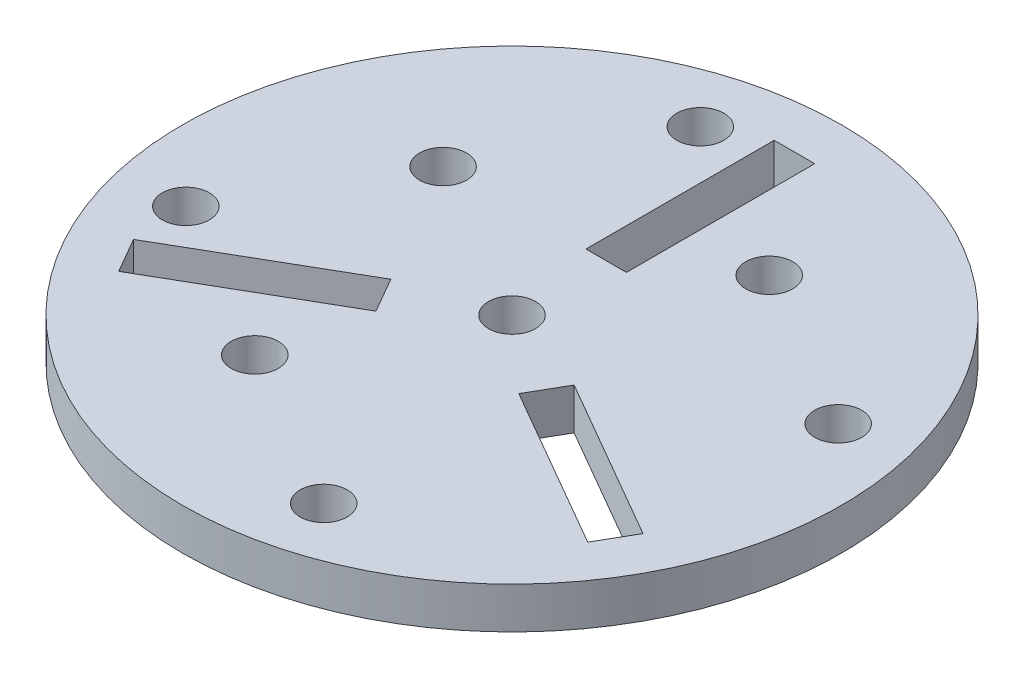
ISO-10303-21;
HEADER;
FILE_DESCRIPTION(('STEP AP214'),'2;1');
FILE_NAME('part.step','',(''),(''),'','','');
FILE_SCHEMA(('AUTOMOTIVE_DESIGN { 1 0 10303 214 1 1 1 1 }'));
ENDSEC;
DATA;
#1=APPLICATION_CONTEXT('core data for automotive mechanical design processes');
#2=APPLICATION_PROTOCOL_DEFINITION('international standard','automotive_design',2000,#1);
#3=PRODUCT_CONTEXT('',#1,'mechanical');
#4=PRODUCT('Part','Part','',(#3));
#5=PRODUCT_RELATED_PRODUCT_CATEGORY('part','',(#4));
#6=PRODUCT_DEFINITION_FORMATION('','',#4);
#7=PRODUCT_DEFINITION_CONTEXT('part definition',#1,'design');
#8=PRODUCT_DEFINITION('design','',#6,#7);
#9=PRODUCT_DEFINITION_SHAPE('','',#8);
#10=(LENGTH_UNIT() NAMED_UNIT(*) SI_UNIT(.MILLI.,.METRE.));
#11=(NAMED_UNIT(*) PLANE_ANGLE_UNIT() SI_UNIT($,.RADIAN.));
#12=(NAMED_UNIT(*) SI_UNIT($,.STERADIAN.) SOLID_ANGLE_UNIT());
#13=UNCERTAINTY_MEASURE_WITH_UNIT(LENGTH_MEASURE(1.E-05),#10,'distance_accuracy_value','');
#14=(GEOMETRIC_REPRESENTATION_CONTEXT(3) GLOBAL_UNCERTAINTY_ASSIGNED_CONTEXT((#13)) GLOBAL_UNIT_ASSIGNED_CONTEXT((#10,
#11,#12)) REPRESENTATION_CONTEXT('',''));
#15=CARTESIAN_POINT('',(0.,0.,0.));
#16=DIRECTION('',(0.,0.,1.));
#17=DIRECTION('',(1.,0.,0.));
#18=AXIS2_PLACEMENT_3D('',#15,#16,#17);
#19=CARTESIAN_POINT('',(0.,5.588,0.));
#20=DIRECTION('',(0.,1.,0.));
#21=DIRECTION('',(0.,0.,1.));
#22=AXIS2_PLACEMENT_3D('',#19,#20,#21);
#23=PLANE('',#22);
#24=CARTESIAN_POINT('',(12.6999999999999,5.588,-21.9970452561248));
#25=DIRECTION('',(0.,1.,0.));
#26=DIRECTION('',(0.,0.,1.));
#27=AXIS2_PLACEMENT_3D('',#24,#25,#26);
#28=CIRCLE('',#27,3.175);
#29=CARTESIAN_POINT('',(12.6999999999999,5.588,-18.8220452561248));
#30=VERTEX_POINT('',#29);
#31=EDGE_CURVE('E405',#30,#30,#28,.T.);
#32=ORIENTED_EDGE('',*,*,#31,.F.);
#33=EDGE_LOOP('',(#32));
#34=FACE_BOUND('',#33,.T.);
#35=CARTESIAN_POINT('',(-9.29704525612483,5.588,-34.6970452561247));
#36=DIRECTION('',(0.,1.,0.));
#37=DIRECTION('',(0.,0.,1.));
#38=AXIS2_PLACEMENT_3D('',#35,#36,#37);
#39=CIRCLE('',#38,3.175);
#40=CARTESIAN_POINT('',(-9.29704525612483,5.588,-31.5220452561247));
#41=VERTEX_POINT('',#40);
#42=EDGE_CURVE('E407',#41,#41,#39,.T.);
#43=ORIENTED_EDGE('',*,*,#42,.F.);
#44=EDGE_LOOP('',(#43));
#45=FACE_BOUND('',#44,.T.);
#46=CARTESIAN_POINT('',(-21.9970452561248,5.588,-12.7));
#47=DIRECTION('',(0.,1.,0.));
#48=DIRECTION('',(0.,0.,1.));
#49=AXIS2_PLACEMENT_3D('',#46,#47,#48);
#50=CIRCLE('',#49,3.175);
#51=CARTESIAN_POINT('',(-21.9970452561248,5.588,-9.52499999999995));
#52=VERTEX_POINT('',#51);
#53=EDGE_CURVE('E413',#52,#52,#50,.T.);
#54=ORIENTED_EDGE('',*,*,#53,.F.);
#55=EDGE_LOOP('',(#54));
#56=FACE_BOUND('',#55,.T.);
#57=CARTESIAN_POINT('',(-34.6970452561247,5.588,9.29704525612481));
#58=DIRECTION('',(0.,1.,0.));
#59=DIRECTION('',(0.,0.,1.));
#60=AXIS2_PLACEMENT_3D('',#57,#58,#59);
#61=CIRCLE('',#60,3.175);
#62=CARTESIAN_POINT('',(-34.6970452561247,5.588,12.4720452561248));
#63=VERTEX_POINT('',#62);
#64=EDGE_CURVE('E419',#63,#63,#61,.T.);
#65=ORIENTED_EDGE('',*,*,#64,.F.);
#66=EDGE_LOOP('',(#65));
#67=FACE_BOUND('',#66,.T.);
#68=CARTESIAN_POINT('',(-12.7,5.588,21.9970452561248));
#69=DIRECTION('',(0.,1.,0.));
#70=DIRECTION('',(0.,0.,1.));
#71=AXIS2_PLACEMENT_3D('',#68,#69,#70);
#72=CIRCLE('',#71,3.175);
#73=CARTESIAN_POINT('',(-12.7,5.588,25.1720452561248));
#74=VERTEX_POINT('',#73);
#75=EDGE_CURVE('E425',#74,#74,#72,.T.);
#76=ORIENTED_EDGE('',*,*,#75,.F.);
#77=EDGE_LOOP('',(#76));
#78=FACE_BOUND('',#77,.T.);
#79=CARTESIAN_POINT('',(9.29704525612482,5.588,34.6970452561247));
#80=DIRECTION('',(0.,1.,0.));
#81=DIRECTION('',(0.,0.,1.));
#82=AXIS2_PLACEMENT_3D('',#79,#80,#81);
#83=CIRCLE('',#82,3.175);
#84=CARTESIAN_POINT('',(9.29704525612482,5.588,37.8720452561247));
#85=VERTEX_POINT('',#84);
#86=EDGE_CURVE('E431',#85,#85,#83,.T.);
#87=ORIENTED_EDGE('',*,*,#86,.F.);
#88=EDGE_LOOP('',(#87));
#89=FACE_BOUND('',#88,.T.);
#90=CARTESIAN_POINT('',(34.6970452561247,5.588,-9.29704525612482));
#91=DIRECTION('',(0.,1.,0.));
#92=DIRECTION('',(0.,0.,1.));
#93=AXIS2_PLACEMENT_3D('',#90,#91,#92);
#94=CIRCLE('',#93,3.175);
#95=CARTESIAN_POINT('',(34.6970452561247,5.588,-6.12204525612482));
#96=VERTEX_POINT('',#95);
#97=EDGE_CURVE('E437',#96,#96,#94,.T.);
#98=ORIENTED_EDGE('',*,*,#97,.F.);
#99=EDGE_LOOP('',(#98));
#100=FACE_BOUND('',#99,.T.);
#101=CARTESIAN_POINT('',(0.,5.588,0.));
#102=DIRECTION('',(0.,1.,0.));
#103=DIRECTION('',(0.,0.,1.));
#104=AXIS2_PLACEMENT_3D('',#101,#102,#103);
#105=CIRCLE('',#104,3.175);
#106=CARTESIAN_POINT('',(0.,5.588,3.175));
#107=VERTEX_POINT('',#106);
#108=EDGE_CURVE('E443',#107,#107,#105,.T.);
#109=ORIENTED_EDGE('',*,*,#108,.F.);
#110=EDGE_LOOP('',(#109));
#111=FACE_BOUND('',#110,.T.);
#112=DIRECTION('',(-0.5,0.,0.866025403784439));
#113=VECTOR('',#112,1.);
#114=CARTESIAN_POINT('',(12.3637726280624,5.588,3.98531763496659));
#115=LINE('',#114,#113);
#116=CARTESIAN_POINT('',(12.3637726280624,5.588,3.98531763496659));
#117=VERTEX_POINT('',#116);
#118=CARTESIAN_POINT('',(9.63327262806238,5.588,8.71468236503341));
#119=VERTEX_POINT('',#118);
#120=EDGE_CURVE('E171',#117,#119,#115,.T.);
#121=ORIENTED_EDGE('',*,*,#120,.F.);
#122=DIRECTION('',(-0.866025403784439,0.,-0.5));
#123=VECTOR('',#122,1.);
#124=CARTESIAN_POINT('',(34.3608178841871,5.588,16.6853176349666));
#125=LINE('',#124,#123);
#126=CARTESIAN_POINT('',(34.3608178841871,5.588,16.6853176349666));
#127=VERTEX_POINT('',#126);
#128=EDGE_CURVE('E169',#127,#117,#125,.T.);
#129=ORIENTED_EDGE('',*,*,#128,.F.);
#130=DIRECTION('',(0.5,0.,-0.866025403784439));
#131=VECTOR('',#130,1.);
#132=CARTESIAN_POINT('',(34.3608178841871,5.588,16.6853176349666));
#133=LINE('',#132,#131);
#134=CARTESIAN_POINT('',(31.6303178841871,5.588,21.4146823650334));
#135=VERTEX_POINT('',#134);
#136=EDGE_CURVE('E177',#135,#127,#133,.T.);
#137=ORIENTED_EDGE('',*,*,#136,.F.);
#138=DIRECTION('',(0.866025403784439,0.,0.5));
#139=VECTOR('',#138,1.);
#140=CARTESIAN_POINT('',(31.6303178841871,5.588,21.4146823650334));
#141=LINE('',#140,#139);
#142=EDGE_CURVE('E174',#119,#135,#141,.T.);
#143=ORIENTED_EDGE('',*,*,#142,.F.);
#144=EDGE_LOOP('',(#121,#129,#137,#143));
#145=FACE_BOUND('',#144,.T.);
#146=CARTESIAN_POINT('',(0.,5.588,0.));
#147=DIRECTION('',(0.,1.,0.));
#148=DIRECTION('',(0.,0.,1.));
#149=AXIS2_PLACEMENT_3D('',#146,#147,#148);
#150=CIRCLE('',#149,44.45);
#151=CARTESIAN_POINT('',(0.,5.588,44.45));
#152=VERTEX_POINT('',#151);
#153=EDGE_CURVE('E12',#152,#152,#150,.T.);
#154=ORIENTED_EDGE('',*,*,#153,.T.);
#155=EDGE_LOOP('',(#154));
#156=FACE_BOUND('',#155,.T.);
#157=DIRECTION('',(1.,0.,0.));
#158=VECTOR('',#157,1.);
#159=CARTESIAN_POINT('',(-2.7305,5.588,-12.7));
#160=LINE('',#159,#158);
#161=CARTESIAN_POINT('',(-2.7305,5.588,-12.7));
#162=VERTEX_POINT('',#161);
#163=CARTESIAN_POINT('',(2.7305,5.588,-12.7));
#164=VERTEX_POINT('',#163);
#165=EDGE_CURVE('E202',#162,#164,#160,.T.);
#166=ORIENTED_EDGE('',*,*,#165,.F.);
#167=DIRECTION('',(0.,0.,1.));
#168=VECTOR('',#167,1.);
#169=CARTESIAN_POINT('',(-2.7305,5.588,-38.1));
#170=LINE('',#169,#168);
#171=CARTESIAN_POINT('',(-2.7305,5.588,-38.1));
#172=VERTEX_POINT('',#171);
#173=EDGE_CURVE('E200',#172,#162,#170,.T.);
#174=ORIENTED_EDGE('',*,*,#173,.F.);
#175=DIRECTION('',(-1.,0.,0.));
#176=VECTOR('',#175,1.);
#177=CARTESIAN_POINT('',(-2.7305,5.588,-38.1));
#178=LINE('',#177,#176);
#179=CARTESIAN_POINT('',(2.7305,5.588,-38.1));
#180=VERTEX_POINT('',#179);
#181=EDGE_CURVE('E208',#180,#172,#178,.T.);
#182=ORIENTED_EDGE('',*,*,#181,.F.);
#183=DIRECTION('',(0.,0.,-1.));
#184=VECTOR('',#183,1.);
#185=CARTESIAN_POINT('',(2.7305,5.588,-38.1));
#186=LINE('',#185,#184);
#187=EDGE_CURVE('E205',#164,#180,#186,.T.);
#188=ORIENTED_EDGE('',*,*,#187,.F.);
#189=EDGE_LOOP('',(#166,#174,#182,#188));
#190=FACE_BOUND('',#189,.T.);
#191=DIRECTION('',(-0.5,0.,-0.866025403784438));
#192=VECTOR('',#191,1.);
#193=CARTESIAN_POINT('',(-9.63327262806236,5.588,8.71468236503342));
#194=LINE('',#193,#192);
#195=CARTESIAN_POINT('',(-9.63327262806236,5.588,8.71468236503342));
#196=VERTEX_POINT('',#195);
#197=CARTESIAN_POINT('',(-12.3637726280624,5.588,3.9853176349666));
#198=VERTEX_POINT('',#197);
#199=EDGE_CURVE('E139',#196,#198,#194,.T.);
#200=ORIENTED_EDGE('',*,*,#199,.F.);
#201=DIRECTION('',(0.866025403784438,0.,-0.5));
#202=VECTOR('',#201,1.);
#203=CARTESIAN_POINT('',(-31.6303178841871,5.588,21.4146823650334));
#204=LINE('',#203,#202);
#205=CARTESIAN_POINT('',(-31.6303178841871,5.588,21.4146823650334));
#206=VERTEX_POINT('',#205);
#207=EDGE_CURVE('E131',#206,#196,#204,.T.);
#208=ORIENTED_EDGE('',*,*,#207,.F.);
#209=DIRECTION('',(0.500000000000001,0.,0.866025403784438));
#210=VECTOR('',#209,1.);
#211=CARTESIAN_POINT('',(-31.6303178841871,5.588,21.4146823650334));
#212=LINE('',#211,#210);
#213=CARTESIAN_POINT('',(-34.3608178841871,5.588,16.6853176349666));
#214=VERTEX_POINT('',#213);
#215=EDGE_CURVE('E153',#214,#206,#212,.T.);
#216=ORIENTED_EDGE('',*,*,#215,.F.);
#217=DIRECTION('',(-0.866025403784438,0.,0.5));
#218=VECTOR('',#217,1.);
#219=CARTESIAN_POINT('',(-34.3608178841871,5.588,16.6853176349666));
#220=LINE('',#219,#218);
#221=EDGE_CURVE('E151',#198,#214,#220,.T.);
#222=ORIENTED_EDGE('',*,*,#221,.F.);
#223=EDGE_LOOP('',(#200,#208,#216,#222));
#224=FACE_BOUND('',#223,.T.);
#225=ADVANCED_FACE('F42',(#34,#45,#56,#67,#78,#89,#100,#111,#145,#156,#190,#224),#23,.T.);
#226=CARTESIAN_POINT('',(0.,0.,0.));
#227=DIRECTION('',(0.,1.,0.));
#228=DIRECTION('',(0.,0.,1.));
#229=AXIS2_PLACEMENT_3D('',#226,#227,#228);
#230=PLANE('',#229);
#231=CARTESIAN_POINT('',(12.6999999999999,0.,-21.9970452561248));
#232=DIRECTION('',(0.,1.,0.));
#233=DIRECTION('',(0.,0.,1.));
#234=AXIS2_PLACEMENT_3D('',#231,#232,#233);
#235=CIRCLE('',#234,3.175);
#236=CARTESIAN_POINT('',(12.6999999999999,0.,-18.8220452561248));
#237=VERTEX_POINT('',#236);
#238=EDGE_CURVE('E403',#237,#237,#235,.T.);
#239=ORIENTED_EDGE('',*,*,#238,.T.);
#240=EDGE_LOOP('',(#239));
#241=FACE_BOUND('',#240,.T.);
#242=CARTESIAN_POINT('',(-9.29704525612483,0.,-34.6970452561247));
#243=DIRECTION('',(0.,1.,0.));
#244=DIRECTION('',(0.,0.,1.));
#245=AXIS2_PLACEMENT_3D('',#242,#243,#244);
#246=CIRCLE('',#245,3.175);
#247=CARTESIAN_POINT('',(-9.29704525612483,0.,-31.5220452561247));
#248=VERTEX_POINT('',#247);
#249=EDGE_CURVE('E410',#248,#248,#246,.T.);
#250=ORIENTED_EDGE('',*,*,#249,.T.);
#251=EDGE_LOOP('',(#250));
#252=FACE_BOUND('',#251,.T.);
#253=CARTESIAN_POINT('',(-21.9970452561248,0.,-12.7));
#254=DIRECTION('',(0.,1.,0.));
#255=DIRECTION('',(0.,0.,1.));
#256=AXIS2_PLACEMENT_3D('',#253,#254,#255);
#257=CIRCLE('',#256,3.175);
#258=CARTESIAN_POINT('',(-21.9970452561248,0.,-9.52499999999995));
#259=VERTEX_POINT('',#258);
#260=EDGE_CURVE('E416',#259,#259,#257,.T.);
#261=ORIENTED_EDGE('',*,*,#260,.T.);
#262=EDGE_LOOP('',(#261));
#263=FACE_BOUND('',#262,.T.);
#264=CARTESIAN_POINT('',(-34.6970452561247,0.,9.29704525612481));
#265=DIRECTION('',(0.,1.,0.));
#266=DIRECTION('',(0.,0.,1.));
#267=AXIS2_PLACEMENT_3D('',#264,#265,#266);
#268=CIRCLE('',#267,3.175);
#269=CARTESIAN_POINT('',(-34.6970452561247,0.,12.4720452561248));
#270=VERTEX_POINT('',#269);
#271=EDGE_CURVE('E422',#270,#270,#268,.T.);
#272=ORIENTED_EDGE('',*,*,#271,.T.);
#273=EDGE_LOOP('',(#272));
#274=FACE_BOUND('',#273,.T.);
#275=CARTESIAN_POINT('',(-12.7,0.,21.9970452561248));
#276=DIRECTION('',(0.,1.,0.));
#277=DIRECTION('',(0.,0.,1.));
#278=AXIS2_PLACEMENT_3D('',#275,#276,#277);
#279=CIRCLE('',#278,3.175);
#280=CARTESIAN_POINT('',(-12.7,0.,25.1720452561248));
#281=VERTEX_POINT('',#280);
#282=EDGE_CURVE('E428',#281,#281,#279,.T.);
#283=ORIENTED_EDGE('',*,*,#282,.T.);
#284=EDGE_LOOP('',(#283));
#285=FACE_BOUND('',#284,.T.);
#286=CARTESIAN_POINT('',(9.29704525612482,0.,34.6970452561247));
#287=DIRECTION('',(0.,1.,0.));
#288=DIRECTION('',(0.,0.,1.));
#289=AXIS2_PLACEMENT_3D('',#286,#287,#288);
#290=CIRCLE('',#289,3.175);
#291=CARTESIAN_POINT('',(9.29704525612482,0.,37.8720452561247));
#292=VERTEX_POINT('',#291);
#293=EDGE_CURVE('E434',#292,#292,#290,.T.);
#294=ORIENTED_EDGE('',*,*,#293,.T.);
#295=EDGE_LOOP('',(#294));
#296=FACE_BOUND('',#295,.T.);
#297=CARTESIAN_POINT('',(34.6970452561247,0.,-9.29704525612482));
#298=DIRECTION('',(0.,1.,0.));
#299=DIRECTION('',(0.,0.,1.));
#300=AXIS2_PLACEMENT_3D('',#297,#298,#299);
#301=CIRCLE('',#300,3.175);
#302=CARTESIAN_POINT('',(34.6970452561247,0.,-6.12204525612482));
#303=VERTEX_POINT('',#302);
#304=EDGE_CURVE('E440',#303,#303,#301,.T.);
#305=ORIENTED_EDGE('',*,*,#304,.T.);
#306=EDGE_LOOP('',(#305));
#307=FACE_BOUND('',#306,.T.);
#308=CARTESIAN_POINT('',(0.,0.,0.));
#309=DIRECTION('',(0.,1.,0.));
#310=DIRECTION('',(0.,0.,1.));
#311=AXIS2_PLACEMENT_3D('',#308,#309,#310);
#312=CIRCLE('',#311,3.175);
#313=CARTESIAN_POINT('',(0.,0.,3.175));
#314=VERTEX_POINT('',#313);
#315=EDGE_CURVE('E159',#314,#314,#312,.T.);
#316=ORIENTED_EDGE('',*,*,#315,.T.);
#317=EDGE_LOOP('',(#316));
#318=FACE_BOUND('',#317,.T.);
#319=DIRECTION('',(-0.866025403784439,0.,-0.5));
#320=VECTOR('',#319,1.);
#321=CARTESIAN_POINT('',(34.3608178841871,0.,16.6853176349666));
#322=LINE('',#321,#320);
#323=CARTESIAN_POINT('',(34.3608178841871,0.,16.6853176349666));
#324=VERTEX_POINT('',#323);
#325=CARTESIAN_POINT('',(12.3637726280624,0.,3.98531763496659));
#326=VERTEX_POINT('',#325);
#327=EDGE_CURVE('E147',#324,#326,#322,.T.);
#328=ORIENTED_EDGE('',*,*,#327,.T.);
#329=DIRECTION('',(-0.5,0.,0.866025403784439));
#330=VECTOR('',#329,1.);
#331=CARTESIAN_POINT('',(12.3637726280624,0.,3.98531763496659));
#332=LINE('',#331,#330);
#333=CARTESIAN_POINT('',(9.63327262806238,0.,8.71468236503341));
#334=VERTEX_POINT('',#333);
#335=EDGE_CURVE('E182',#326,#334,#332,.T.);
#336=ORIENTED_EDGE('',*,*,#335,.T.);
#337=DIRECTION('',(0.866025403784439,0.,0.5));
#338=VECTOR('',#337,1.);
#339=CARTESIAN_POINT('',(31.6303178841871,0.,21.4146823650334));
#340=LINE('',#339,#338);
#341=CARTESIAN_POINT('',(31.6303178841871,0.,21.4146823650334));
#342=VERTEX_POINT('',#341);
#343=EDGE_CURVE('E185',#334,#342,#340,.T.);
#344=ORIENTED_EDGE('',*,*,#343,.T.);
#345=DIRECTION('',(0.5,0.,-0.866025403784439));
#346=VECTOR('',#345,1.);
#347=CARTESIAN_POINT('',(34.3608178841871,0.,16.6853176349666));
#348=LINE('',#347,#346);
#349=EDGE_CURVE('E172',#342,#324,#348,.T.);
#350=ORIENTED_EDGE('',*,*,#349,.T.);
#351=EDGE_LOOP('',(#328,#336,#344,#350));
#352=FACE_BOUND('',#351,.T.);
#353=CARTESIAN_POINT('',(0.,0.,0.));
#354=DIRECTION('',(0.,1.,0.));
#355=DIRECTION('',(0.,0.,1.));
#356=AXIS2_PLACEMENT_3D('',#353,#354,#355);
#357=CIRCLE('',#356,44.45);
#358=CARTESIAN_POINT('',(0.,0.,44.45));
#359=VERTEX_POINT('',#358);
#360=EDGE_CURVE('E46',#359,#359,#357,.T.);
#361=ORIENTED_EDGE('',*,*,#360,.F.);
#362=EDGE_LOOP('',(#361));
#363=FACE_BOUND('',#362,.T.);
#364=DIRECTION('',(0.,0.,1.));
#365=VECTOR('',#364,1.);
#366=CARTESIAN_POINT('',(-2.7305,0.,-38.1));
#367=LINE('',#366,#365);
#368=CARTESIAN_POINT('',(-2.7305,0.,-38.1));
#369=VERTEX_POINT('',#368);
#370=CARTESIAN_POINT('',(-2.7305,0.,-12.7));
#371=VERTEX_POINT('',#370);
#372=EDGE_CURVE('E199',#369,#371,#367,.T.);
#373=ORIENTED_EDGE('',*,*,#372,.T.);
#374=DIRECTION('',(1.,0.,0.));
#375=VECTOR('',#374,1.);
#376=CARTESIAN_POINT('',(-2.7305,0.,-12.7));
#377=LINE('',#376,#375);
#378=CARTESIAN_POINT('',(2.7305,0.,-12.7));
#379=VERTEX_POINT('',#378);
#380=EDGE_CURVE('E213',#371,#379,#377,.T.);
#381=ORIENTED_EDGE('',*,*,#380,.T.);
#382=DIRECTION('',(0.,0.,-1.));
#383=VECTOR('',#382,1.);
#384=CARTESIAN_POINT('',(2.7305,0.,-38.1));
#385=LINE('',#384,#383);
#386=CARTESIAN_POINT('',(2.7305,0.,-38.1));
#387=VERTEX_POINT('',#386);
#388=EDGE_CURVE('E216',#379,#387,#385,.T.);
#389=ORIENTED_EDGE('',*,*,#388,.T.);
#390=DIRECTION('',(-1.,0.,0.));
#391=VECTOR('',#390,1.);
#392=CARTESIAN_POINT('',(-2.7305,0.,-38.1));
#393=LINE('',#392,#391);
#394=EDGE_CURVE('E203',#387,#369,#393,.T.);
#395=ORIENTED_EDGE('',*,*,#394,.T.);
#396=EDGE_LOOP('',(#373,#381,#389,#395));
#397=FACE_BOUND('',#396,.T.);
#398=DIRECTION('',(0.866025403784438,0.,-0.5));
#399=VECTOR('',#398,1.);
#400=CARTESIAN_POINT('',(-31.6303178841871,0.,21.4146823650334));
#401=LINE('',#400,#399);
#402=CARTESIAN_POINT('',(-31.6303178841871,0.,21.4146823650334));
#403=VERTEX_POINT('',#402);
#404=CARTESIAN_POINT('',(-9.63327262806236,0.,8.71468236503342));
#405=VERTEX_POINT('',#404);
#406=EDGE_CURVE('E65',#403,#405,#401,.T.);
#407=ORIENTED_EDGE('',*,*,#406,.T.);
#408=DIRECTION('',(-0.5,0.,-0.866025403784438));
#409=VECTOR('',#408,1.);
#410=CARTESIAN_POINT('',(-9.63327262806236,0.,8.71468236503342));
#411=LINE('',#410,#409);
#412=CARTESIAN_POINT('',(-12.3637726280624,0.,3.9853176349666));
#413=VERTEX_POINT('',#412);
#414=EDGE_CURVE('E146',#405,#413,#411,.T.);
#415=ORIENTED_EDGE('',*,*,#414,.T.);
#416=DIRECTION('',(-0.866025403784438,0.,0.5));
#417=VECTOR('',#416,1.);
#418=CARTESIAN_POINT('',(-34.3608178841871,0.,16.6853176349666));
#419=LINE('',#418,#417);
#420=CARTESIAN_POINT('',(-34.3608178841871,0.,16.6853176349666));
#421=VERTEX_POINT('',#420);
#422=EDGE_CURVE('E161',#413,#421,#419,.T.);
#423=ORIENTED_EDGE('',*,*,#422,.T.);
#424=DIRECTION('',(0.500000000000001,0.,0.866025403784438));
#425=VECTOR('',#424,1.);
#426=CARTESIAN_POINT('',(-31.6303178841871,0.,21.4146823650334));
#427=LINE('',#426,#425);
#428=EDGE_CURVE('E140',#421,#403,#427,.T.);
#429=ORIENTED_EDGE('',*,*,#428,.T.);
#430=EDGE_LOOP('',(#407,#415,#423,#429));
#431=FACE_BOUND('',#430,.T.);
#432=ADVANCED_FACE('F235',(#241,#252,#263,#274,#285,#296,#307,#318,#352,#363,#397,#431),#230,.F.);
#433=CARTESIAN_POINT('',(0.,5.588,0.));
#434=DIRECTION('',(0.,-1.,0.));
#435=DIRECTION('',(0.,0.,-1.));
#436=AXIS2_PLACEMENT_3D('',#433,#434,#435);
#437=CYLINDRICAL_SURFACE('',#436,44.45);
#438=ORIENTED_EDGE('',*,*,#153,.F.);
#439=EDGE_LOOP('',(#438));
#440=FACE_BOUND('',#439,.T.);
#441=ORIENTED_EDGE('',*,*,#360,.T.);
#442=EDGE_LOOP('',(#441));
#443=FACE_BOUND('',#442,.T.);
#444=ADVANCED_FACE('F44',(#440,#443),#437,.T.);
#445=CARTESIAN_POINT('',(-2.7305,5.588,-38.1));
#446=DIRECTION('',(1.,0.,0.));
#447=DIRECTION('',(0.,0.,-1.));
#448=AXIS2_PLACEMENT_3D('',#445,#446,#447);
#449=PLANE('',#448);
#450=ORIENTED_EDGE('',*,*,#372,.F.);
#451=DIRECTION('',(0.,-1.,0.));
#452=VECTOR('',#451,1.);
#453=CARTESIAN_POINT('',(-2.7305,5.588,-38.1));
#454=LINE('',#453,#452);
#455=EDGE_CURVE('E210',#172,#369,#454,.T.);
#456=ORIENTED_EDGE('',*,*,#455,.F.);
#457=ORIENTED_EDGE('',*,*,#173,.T.);
#458=DIRECTION('',(0.,-1.,0.));
#459=VECTOR('',#458,1.);
#460=CARTESIAN_POINT('',(-2.7305,5.588,-12.7));
#461=LINE('',#460,#459);
#462=EDGE_CURVE('E227',#162,#371,#461,.T.);
#463=ORIENTED_EDGE('',*,*,#462,.T.);
#464=EDGE_LOOP('',(#450,#456,#457,#463));
#465=FACE_BOUND('',#464,.T.);
#466=ADVANCED_FACE('F263',(#465),#449,.T.);
#467=CARTESIAN_POINT('',(-2.7305,5.588,-12.7));
#468=DIRECTION('',(0.,0.,-1.));
#469=DIRECTION('',(-1.,0.,0.));
#470=AXIS2_PLACEMENT_3D('',#467,#468,#469);
#471=PLANE('',#470);
#472=ORIENTED_EDGE('',*,*,#380,.F.);
#473=ORIENTED_EDGE('',*,*,#462,.F.);
#474=ORIENTED_EDGE('',*,*,#165,.T.);
#475=DIRECTION('',(0.,-1.,0.));
#476=VECTOR('',#475,1.);
#477=CARTESIAN_POINT('',(2.7305,5.588,-12.7));
#478=LINE('',#477,#476);
#479=EDGE_CURVE('E225',#164,#379,#478,.T.);
#480=ORIENTED_EDGE('',*,*,#479,.T.);
#481=EDGE_LOOP('',(#472,#473,#474,#480));
#482=FACE_BOUND('',#481,.T.);
#483=ADVANCED_FACE('F266',(#482),#471,.T.);
#484=CARTESIAN_POINT('',(2.7305,5.588,-38.1));
#485=DIRECTION('',(-1.,0.,0.));
#486=DIRECTION('',(0.,0.,1.));
#487=AXIS2_PLACEMENT_3D('',#484,#485,#486);
#488=PLANE('',#487);
#489=ORIENTED_EDGE('',*,*,#388,.F.);
#490=ORIENTED_EDGE('',*,*,#479,.F.);
#491=ORIENTED_EDGE('',*,*,#187,.T.);
#492=DIRECTION('',(0.,-1.,0.));
#493=VECTOR('',#492,1.);
#494=CARTESIAN_POINT('',(2.7305,5.588,-38.1));
#495=LINE('',#494,#493);
#496=EDGE_CURVE('E223',#180,#387,#495,.T.);
#497=ORIENTED_EDGE('',*,*,#496,.T.);
#498=EDGE_LOOP('',(#489,#490,#491,#497));
#499=FACE_BOUND('',#498,.T.);
#500=ADVANCED_FACE('F269',(#499),#488,.T.);
#501=CARTESIAN_POINT('',(-2.7305,5.588,-38.1));
#502=DIRECTION('',(0.,0.,1.));
#503=DIRECTION('',(1.,0.,0.));
#504=AXIS2_PLACEMENT_3D('',#501,#502,#503);
#505=PLANE('',#504);
#506=ORIENTED_EDGE('',*,*,#394,.F.);
#507=ORIENTED_EDGE('',*,*,#496,.F.);
#508=ORIENTED_EDGE('',*,*,#181,.T.);
#509=ORIENTED_EDGE('',*,*,#455,.T.);
#510=EDGE_LOOP('',(#506,#507,#508,#509));
#511=FACE_BOUND('',#510,.T.);
#512=ADVANCED_FACE('F273',(#511),#505,.T.);
#513=CARTESIAN_POINT('',(34.3608178841871,5.588,16.6853176349666));
#514=DIRECTION('',(-0.5,0.,0.866025403784439));
#515=DIRECTION('',(0.866025403784439,0.,0.5));
#516=AXIS2_PLACEMENT_3D('',#513,#514,#515);
#517=PLANE('',#516);
#518=ORIENTED_EDGE('',*,*,#327,.F.);
#519=DIRECTION('',(0.,-1.,0.));
#520=VECTOR('',#519,1.);
#521=CARTESIAN_POINT('',(34.3608178841871,5.588,16.6853176349666));
#522=LINE('',#521,#520);
#523=EDGE_CURVE('E179',#127,#324,#522,.T.);
#524=ORIENTED_EDGE('',*,*,#523,.F.);
#525=ORIENTED_EDGE('',*,*,#128,.T.);
#526=DIRECTION('',(0.,-1.,0.));
#527=VECTOR('',#526,1.);
#528=CARTESIAN_POINT('',(12.3637726280624,5.588,3.98531763496659));
#529=LINE('',#528,#527);
#530=EDGE_CURVE('E196',#117,#326,#529,.T.);
#531=ORIENTED_EDGE('',*,*,#530,.T.);
#532=EDGE_LOOP('',(#518,#524,#525,#531));
#533=FACE_BOUND('',#532,.T.);
#534=ADVANCED_FACE('F277',(#533),#517,.T.);
#535=CARTESIAN_POINT('',(12.3637726280624,5.588,3.98531763496659));
#536=DIRECTION('',(0.866025403784439,0.,0.5));
#537=DIRECTION('',(0.5,0.,-0.866025403784439));
#538=AXIS2_PLACEMENT_3D('',#535,#536,#537);
#539=PLANE('',#538);
#540=ORIENTED_EDGE('',*,*,#335,.F.);
#541=ORIENTED_EDGE('',*,*,#530,.F.);
#542=ORIENTED_EDGE('',*,*,#120,.T.);
#543=DIRECTION('',(0.,-1.,0.));
#544=VECTOR('',#543,1.);
#545=CARTESIAN_POINT('',(9.63327262806238,5.588,8.71468236503341));
#546=LINE('',#545,#544);
#547=EDGE_CURVE('E194',#119,#334,#546,.T.);
#548=ORIENTED_EDGE('',*,*,#547,.T.);
#549=EDGE_LOOP('',(#540,#541,#542,#548));
#550=FACE_BOUND('',#549,.T.);
#551=ADVANCED_FACE('F281',(#550),#539,.T.);
#552=CARTESIAN_POINT('',(31.6303178841871,5.588,21.4146823650334));
#553=DIRECTION('',(0.5,0.,-0.866025403784439));
#554=DIRECTION('',(-0.866025403784439,0.,-0.5));
#555=AXIS2_PLACEMENT_3D('',#552,#553,#554);
#556=PLANE('',#555);
#557=ORIENTED_EDGE('',*,*,#343,.F.);
#558=ORIENTED_EDGE('',*,*,#547,.F.);
#559=ORIENTED_EDGE('',*,*,#142,.T.);
#560=DIRECTION('',(0.,-1.,0.));
#561=VECTOR('',#560,1.);
#562=CARTESIAN_POINT('',(31.6303178841871,5.588,21.4146823650334));
#563=LINE('',#562,#561);
#564=EDGE_CURVE('E192',#135,#342,#563,.T.);
#565=ORIENTED_EDGE('',*,*,#564,.T.);
#566=EDGE_LOOP('',(#557,#558,#559,#565));
#567=FACE_BOUND('',#566,.T.);
#568=ADVANCED_FACE('F285',(#567),#556,.T.);
#569=CARTESIAN_POINT('',(34.3608178841871,5.588,16.6853176349666));
#570=DIRECTION('',(-0.866025403784439,0.,-0.5));
#571=DIRECTION('',(-0.5,0.,0.866025403784439));
#572=AXIS2_PLACEMENT_3D('',#569,#570,#571);
#573=PLANE('',#572);
#574=ORIENTED_EDGE('',*,*,#349,.F.);
#575=ORIENTED_EDGE('',*,*,#564,.F.);
#576=ORIENTED_EDGE('',*,*,#136,.T.);
#577=ORIENTED_EDGE('',*,*,#523,.T.);
#578=EDGE_LOOP('',(#574,#575,#576,#577));
#579=FACE_BOUND('',#578,.T.);
#580=ADVANCED_FACE('F289',(#579),#573,.T.);
#581=CARTESIAN_POINT('',(-31.6303178841871,5.588,21.4146823650334));
#582=DIRECTION('',(-0.5,0.,-0.866025403784438));
#583=DIRECTION('',(-0.866025403784438,0.,0.5));
#584=AXIS2_PLACEMENT_3D('',#581,#582,#583);
#585=PLANE('',#584);
#586=ORIENTED_EDGE('',*,*,#406,.F.);
#587=DIRECTION('',(0.,-1.,0.));
#588=VECTOR('',#587,1.);
#589=CARTESIAN_POINT('',(-31.6303178841871,5.588,21.4146823650334));
#590=LINE('',#589,#588);
#591=EDGE_CURVE('E135',#206,#403,#590,.T.);
#592=ORIENTED_EDGE('',*,*,#591,.F.);
#593=ORIENTED_EDGE('',*,*,#207,.T.);
#594=DIRECTION('',(0.,-1.,0.));
#595=VECTOR('',#594,1.);
#596=CARTESIAN_POINT('',(-9.63327262806236,5.588,8.71468236503342));
#597=LINE('',#596,#595);
#598=EDGE_CURVE('E134',#196,#405,#597,.T.);
#599=ORIENTED_EDGE('',*,*,#598,.T.);
#600=EDGE_LOOP('',(#586,#592,#593,#599));
#601=FACE_BOUND('',#600,.T.);
#602=ADVANCED_FACE('F133',(#601),#585,.T.);
#603=CARTESIAN_POINT('',(-9.63327262806236,5.588,8.71468236503342));
#604=DIRECTION('',(-0.866025403784438,0.,0.5));
#605=DIRECTION('',(0.5,0.,0.866025403784438));
#606=AXIS2_PLACEMENT_3D('',#603,#604,#605);
#607=PLANE('',#606);
#608=ORIENTED_EDGE('',*,*,#414,.F.);
#609=ORIENTED_EDGE('',*,*,#598,.F.);
#610=ORIENTED_EDGE('',*,*,#199,.T.);
#611=DIRECTION('',(0.,-1.,0.));
#612=VECTOR('',#611,1.);
#613=CARTESIAN_POINT('',(-12.3637726280624,5.588,3.9853176349666));
#614=LINE('',#613,#612);
#615=EDGE_CURVE('E148',#198,#413,#614,.T.);
#616=ORIENTED_EDGE('',*,*,#615,.T.);
#617=EDGE_LOOP('',(#608,#609,#610,#616));
#618=FACE_BOUND('',#617,.T.);
#619=ADVANCED_FACE('F143',(#618),#607,.T.);
#620=CARTESIAN_POINT('',(-34.3608178841871,5.588,16.6853176349666));
#621=DIRECTION('',(0.5,0.,0.866025403784438));
#622=DIRECTION('',(0.866025403784438,0.,-0.5));
#623=AXIS2_PLACEMENT_3D('',#620,#621,#622);
#624=PLANE('',#623);
#625=ORIENTED_EDGE('',*,*,#422,.F.);
#626=ORIENTED_EDGE('',*,*,#615,.F.);
#627=ORIENTED_EDGE('',*,*,#221,.T.);
#628=DIRECTION('',(0.,-1.,0.));
#629=VECTOR('',#628,1.);
#630=CARTESIAN_POINT('',(-34.3608178841871,5.588,16.6853176349666));
#631=LINE('',#630,#629);
#632=EDGE_CURVE('E57',#214,#421,#631,.T.);
#633=ORIENTED_EDGE('',*,*,#632,.T.);
#634=EDGE_LOOP('',(#625,#626,#627,#633));
#635=FACE_BOUND('',#634,.T.);
#636=ADVANCED_FACE('F244',(#635),#624,.T.);
#637=CARTESIAN_POINT('',(-31.6303178841871,5.588,21.4146823650334));
#638=DIRECTION('',(0.866025403784438,0.,-0.5));
#639=DIRECTION('',(-0.5,0.,-0.866025403784438));
#640=AXIS2_PLACEMENT_3D('',#637,#638,#639);
#641=PLANE('',#640);
#642=ORIENTED_EDGE('',*,*,#428,.F.);
#643=ORIENTED_EDGE('',*,*,#632,.F.);
#644=ORIENTED_EDGE('',*,*,#215,.T.);
#645=ORIENTED_EDGE('',*,*,#591,.T.);
#646=EDGE_LOOP('',(#642,#643,#644,#645));
#647=FACE_BOUND('',#646,.T.);
#648=ADVANCED_FACE('F241',(#647),#641,.T.);
#649=CARTESIAN_POINT('',(0.,0.,0.));
#650=DIRECTION('',(0.,1.,0.));
#651=DIRECTION('',(0.,0.,1.));
#652=AXIS2_PLACEMENT_3D('',#649,#650,#651);
#653=CYLINDRICAL_SURFACE('',#652,3.175);
#654=ORIENTED_EDGE('',*,*,#315,.F.);
#655=EDGE_LOOP('',(#654));
#656=FACE_BOUND('',#655,.T.);
#657=ORIENTED_EDGE('',*,*,#108,.T.);
#658=EDGE_LOOP('',(#657));
#659=FACE_BOUND('',#658,.T.);
#660=ADVANCED_FACE('F243',(#656,#659),#653,.F.);
#661=CARTESIAN_POINT('',(34.6970452561247,0.,-9.29704525612482));
#662=DIRECTION('',(0.,1.,0.));
#663=DIRECTION('',(0.,0.,1.));
#664=AXIS2_PLACEMENT_3D('',#661,#662,#663);
#665=CYLINDRICAL_SURFACE('',#664,3.175);
#666=ORIENTED_EDGE('',*,*,#304,.F.);
#667=EDGE_LOOP('',(#666));
#668=FACE_BOUND('',#667,.T.);
#669=ORIENTED_EDGE('',*,*,#97,.T.);
#670=EDGE_LOOP('',(#669));
#671=FACE_BOUND('',#670,.T.);
#672=ADVANCED_FACE('F250',(#668,#671),#665,.F.);
#673=CARTESIAN_POINT('',(9.29704525612482,0.,34.6970452561247));
#674=DIRECTION('',(0.,1.,0.));
#675=DIRECTION('',(0.,0.,1.));
#676=AXIS2_PLACEMENT_3D('',#673,#674,#675);
#677=CYLINDRICAL_SURFACE('',#676,3.175);
#678=ORIENTED_EDGE('',*,*,#293,.F.);
#679=EDGE_LOOP('',(#678));
#680=FACE_BOUND('',#679,.T.);
#681=ORIENTED_EDGE('',*,*,#86,.T.);
#682=EDGE_LOOP('',(#681));
#683=FACE_BOUND('',#682,.T.);
#684=ADVANCED_FACE('F336',(#680,#683),#677,.F.);
#685=CARTESIAN_POINT('',(-12.7,0.,21.9970452561248));
#686=DIRECTION('',(0.,1.,0.));
#687=DIRECTION('',(0.,0.,1.));
#688=AXIS2_PLACEMENT_3D('',#685,#686,#687);
#689=CYLINDRICAL_SURFACE('',#688,3.175);
#690=ORIENTED_EDGE('',*,*,#282,.F.);
#691=EDGE_LOOP('',(#690));
#692=FACE_BOUND('',#691,.T.);
#693=ORIENTED_EDGE('',*,*,#75,.T.);
#694=EDGE_LOOP('',(#693));
#695=FACE_BOUND('',#694,.T.);
#696=ADVANCED_FACE('F346',(#692,#695),#689,.F.);
#697=CARTESIAN_POINT('',(-34.6970452561247,0.,9.29704525612481));
#698=DIRECTION('',(0.,1.,0.));
#699=DIRECTION('',(0.,0.,1.));
#700=AXIS2_PLACEMENT_3D('',#697,#698,#699);
#701=CYLINDRICAL_SURFACE('',#700,3.175);
#702=ORIENTED_EDGE('',*,*,#271,.F.);
#703=EDGE_LOOP('',(#702));
#704=FACE_BOUND('',#703,.T.);
#705=ORIENTED_EDGE('',*,*,#64,.T.);
#706=EDGE_LOOP('',(#705));
#707=FACE_BOUND('',#706,.T.);
#708=ADVANCED_FACE('F356',(#704,#707),#701,.F.);
#709=CARTESIAN_POINT('',(-21.9970452561248,0.,-12.7));
#710=DIRECTION('',(0.,1.,0.));
#711=DIRECTION('',(0.,0.,1.));
#712=AXIS2_PLACEMENT_3D('',#709,#710,#711);
#713=CYLINDRICAL_SURFACE('',#712,3.175);
#714=ORIENTED_EDGE('',*,*,#260,.F.);
#715=EDGE_LOOP('',(#714));
#716=FACE_BOUND('',#715,.T.);
#717=ORIENTED_EDGE('',*,*,#53,.T.);
#718=EDGE_LOOP('',(#717));
#719=FACE_BOUND('',#718,.T.);
#720=ADVANCED_FACE('F366',(#716,#719),#713,.F.);
#721=CARTESIAN_POINT('',(-9.29704525612483,0.,-34.6970452561247));
#722=DIRECTION('',(0.,1.,0.));
#723=DIRECTION('',(0.,0.,1.));
#724=AXIS2_PLACEMENT_3D('',#721,#722,#723);
#725=CYLINDRICAL_SURFACE('',#724,3.175);
#726=ORIENTED_EDGE('',*,*,#249,.F.);
#727=EDGE_LOOP('',(#726));
#728=FACE_BOUND('',#727,.T.);
#729=ORIENTED_EDGE('',*,*,#42,.T.);
#730=EDGE_LOOP('',(#729));
#731=FACE_BOUND('',#730,.T.);
#732=ADVANCED_FACE('F376',(#728,#731),#725,.F.);
#733=CARTESIAN_POINT('',(12.6999999999999,0.,-21.9970452561248));
#734=DIRECTION('',(0.,1.,0.));
#735=DIRECTION('',(0.,0.,1.));
#736=AXIS2_PLACEMENT_3D('',#733,#734,#735);
#737=CYLINDRICAL_SURFACE('',#736,3.175);
#738=ORIENTED_EDGE('',*,*,#238,.F.);
#739=EDGE_LOOP('',(#738));
#740=FACE_BOUND('',#739,.T.);
#741=ORIENTED_EDGE('',*,*,#31,.T.);
#742=EDGE_LOOP('',(#741));
#743=FACE_BOUND('',#742,.T.);
#744=ADVANCED_FACE('F386',(#740,#743),#737,.F.);
#745=CLOSED_SHELL('',(#225,#432,#444,#466,#483,#500,#512,#534,#551,#568,#580,#602,#619,#636,
#648,#660,#672,#684,#696,#708,#720,#732,#744));
#746=MANIFOLD_SOLID_BREP('B2',#745);
#747=ADVANCED_BREP_SHAPE_REPRESENTATION('',(#18,#746),#14);
#748=SHAPE_DEFINITION_REPRESENTATION(#9,#747);
ENDSEC;
END-ISO-10303-21;
